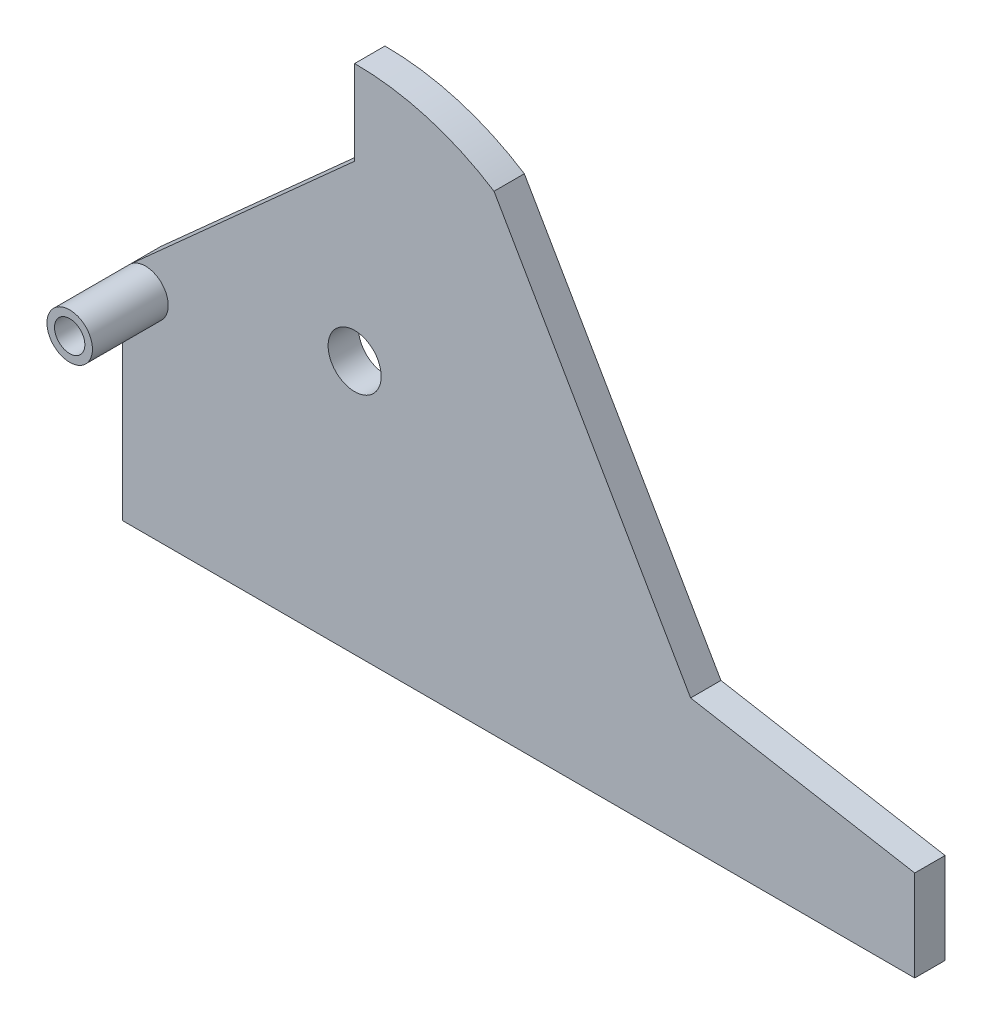
ISO-10303-21;
HEADER;
FILE_DESCRIPTION(('STEP AP214'),'2;1');
FILE_NAME('part.step','',(''),(''),'','','');
FILE_SCHEMA(('AUTOMOTIVE_DESIGN { 1 0 10303 214 1 1 1 1 }'));
ENDSEC;
DATA;
#1=APPLICATION_CONTEXT('core data for automotive mechanical design processes');
#2=APPLICATION_PROTOCOL_DEFINITION('international standard','automotive_design',2000,#1);
#3=PRODUCT_CONTEXT('',#1,'mechanical');
#4=PRODUCT('Part','Part','',(#3));
#5=PRODUCT_RELATED_PRODUCT_CATEGORY('part','',(#4));
#6=PRODUCT_DEFINITION_FORMATION('','',#4);
#7=PRODUCT_DEFINITION_CONTEXT('part definition',#1,'design');
#8=PRODUCT_DEFINITION('design','',#6,#7);
#9=PRODUCT_DEFINITION_SHAPE('','',#8);
#10=(LENGTH_UNIT() NAMED_UNIT(*) SI_UNIT(.MILLI.,.METRE.));
#11=(NAMED_UNIT(*) PLANE_ANGLE_UNIT() SI_UNIT($,.RADIAN.));
#12=(NAMED_UNIT(*) SI_UNIT($,.STERADIAN.) SOLID_ANGLE_UNIT());
#13=UNCERTAINTY_MEASURE_WITH_UNIT(LENGTH_MEASURE(1.E-05),#10,'distance_accuracy_value','');
#14=(GEOMETRIC_REPRESENTATION_CONTEXT(3) GLOBAL_UNCERTAINTY_ASSIGNED_CONTEXT((#13)) GLOBAL_UNIT_ASSIGNED_CONTEXT((#10,
#11,#12)) REPRESENTATION_CONTEXT('',''));
#15=CARTESIAN_POINT('',(0.,0.,0.));
#16=DIRECTION('',(0.,0.,1.));
#17=DIRECTION('',(1.,0.,0.));
#18=AXIS2_PLACEMENT_3D('',#15,#16,#17);
#19=CARTESIAN_POINT('',(153.,167.740187298071,20.));
#20=DIRECTION('',(0.,0.,-1.));
#21=DIRECTION('',(-1.,0.,0.));
#22=AXIS2_PLACEMENT_3D('',#19,#20,#21);
#23=CYLINDRICAL_SURFACE('',#22,170.);
#24=CARTESIAN_POINT('',(153.,167.740187298071,0.));
#25=DIRECTION('',(0.,0.,1.));
#26=DIRECTION('',(1.,0.,0.));
#27=AXIS2_PLACEMENT_3D('',#24,#25,#26);
#28=CIRCLE('',#27,170.);
#29=CARTESIAN_POINT('',(244.94,310.733321398979,0.));
#30=VERTEX_POINT('',#29);
#31=CARTESIAN_POINT('',(153.,337.740187298071,0.));
#32=VERTEX_POINT('',#31);
#33=EDGE_CURVE('E252',#30,#32,#28,.T.);
#34=ORIENTED_EDGE('',*,*,#33,.T.);
#35=DIRECTION('',(0.,0.,-1.));
#36=VECTOR('',#35,1.);
#37=CARTESIAN_POINT('',(153.,337.740187298071,20.));
#38=LINE('',#37,#36);
#39=CARTESIAN_POINT('',(153.,337.740187298071,20.));
#40=VERTEX_POINT('',#39);
#41=EDGE_CURVE('E216',#40,#32,#38,.T.);
#42=ORIENTED_EDGE('',*,*,#41,.F.);
#43=CARTESIAN_POINT('',(153.,167.740187298071,20.));
#44=DIRECTION('',(0.,0.,1.));
#45=DIRECTION('',(1.,0.,0.));
#46=AXIS2_PLACEMENT_3D('',#43,#44,#45);
#47=CIRCLE('',#46,170.);
#48=CARTESIAN_POINT('',(244.94,310.733321398979,20.));
#49=VERTEX_POINT('',#48);
#50=EDGE_CURVE('E238',#49,#40,#47,.T.);
#51=ORIENTED_EDGE('',*,*,#50,.F.);
#52=DIRECTION('',(0.,0.,-1.));
#53=VECTOR('',#52,1.);
#54=CARTESIAN_POINT('',(244.94,310.733321398979,20.));
#55=LINE('',#54,#53);
#56=EDGE_CURVE('E114',#49,#30,#55,.T.);
#57=ORIENTED_EDGE('',*,*,#56,.T.);
#58=EDGE_LOOP('',(#34,#42,#51,#57));
#59=FACE_BOUND('',#58,.T.);
#60=ADVANCED_FACE('F104',(#59),#23,.T.);
#61=CARTESIAN_POINT('',(153.,0.,20.));
#62=DIRECTION('',(-1.,0.,0.));
#63=DIRECTION('',(0.,0.,1.));
#64=AXIS2_PLACEMENT_3D('',#61,#62,#63);
#65=PLANE('',#64);
#66=DIRECTION('',(0.,1.,0.));
#67=VECTOR('',#66,1.);
#68=CARTESIAN_POINT('',(153.,0.,0.));
#69=LINE('',#68,#67);
#70=CARTESIAN_POINT('',(153.,281.918848090833,0.));
#71=VERTEX_POINT('',#70);
#72=EDGE_CURVE('E255',#71,#32,#69,.T.);
#73=ORIENTED_EDGE('',*,*,#72,.F.);
#74=DIRECTION('',(0.,0.,-1.));
#75=VECTOR('',#74,1.);
#76=CARTESIAN_POINT('',(153.,281.918848090833,20.));
#77=LINE('',#76,#75);
#78=CARTESIAN_POINT('',(153.,281.918848090833,20.));
#79=VERTEX_POINT('',#78);
#80=EDGE_CURVE('E214',#79,#71,#77,.T.);
#81=ORIENTED_EDGE('',*,*,#80,.F.);
#82=DIRECTION('',(0.,1.,0.));
#83=VECTOR('',#82,1.);
#84=CARTESIAN_POINT('',(153.,0.,20.));
#85=LINE('',#84,#83);
#86=EDGE_CURVE('E240',#79,#40,#85,.T.);
#87=ORIENTED_EDGE('',*,*,#86,.T.);
#88=ORIENTED_EDGE('',*,*,#41,.T.);
#89=EDGE_LOOP('',(#73,#81,#87,#88));
#90=FACE_BOUND('',#89,.T.);
#91=ADVANCED_FACE('F284',(#90),#65,.T.);
#92=CARTESIAN_POINT('',(-71.9216253841728,80.190761516644,20.));
#93=DIRECTION('',(-0.66768118292682,0.744447337268019,0.));
#94=DIRECTION('',(-0.744447337268019,-0.66768118292682,0.));
#95=AXIS2_PLACEMENT_3D('',#92,#93,#94);
#96=PLANE('',#95);
#97=DIRECTION('',(0.744447337268019,0.66768118292682,0.));
#98=VECTOR('',#97,1.);
#99=CARTESIAN_POINT('',(-71.9216253841728,80.190761516644,0.));
#100=LINE('',#99,#98);
#101=CARTESIAN_POINT('',(4.98478225609769,149.16671005902,0.));
#102=VERTEX_POINT('',#101);
#103=EDGE_CURVE('E258',#102,#71,#100,.T.);
#104=ORIENTED_EDGE('',*,*,#103,.F.);
#105=DIRECTION('',(0.,0.,-1.));
#106=VECTOR('',#105,1.);
#107=CARTESIAN_POINT('',(4.98478225609769,149.16671005902,20.));
#108=LINE('',#107,#106);
#109=CARTESIAN_POINT('',(4.9847822560977,149.16671005902,20.));
#110=VERTEX_POINT('',#109);
#111=EDGE_CURVE('E212',#110,#102,#108,.T.);
#112=ORIENTED_EDGE('',*,*,#111,.F.);
#113=DIRECTION('',(0.744447337268019,0.66768118292682,0.));
#114=VECTOR('',#113,1.);
#115=CARTESIAN_POINT('',(-71.9216253841728,80.190761516644,20.));
#116=LINE('',#115,#114);
#117=EDGE_CURVE('E243',#110,#79,#116,.T.);
#118=ORIENTED_EDGE('',*,*,#117,.T.);
#119=ORIENTED_EDGE('',*,*,#80,.T.);
#120=EDGE_LOOP('',(#104,#112,#118,#119));
#121=FACE_BOUND('',#120,.T.);
#122=ADVANCED_FACE('F289',(#121),#96,.T.);
#123=CARTESIAN_POINT('',(0.,0.,20.));
#124=DIRECTION('',(-1.,0.,0.));
#125=DIRECTION('',(0.,0.,1.));
#126=AXIS2_PLACEMENT_3D('',#123,#124,#125);
#127=PLANE('',#126);
#128=DIRECTION('',(0.,1.,0.));
#129=VECTOR('',#128,1.);
#130=CARTESIAN_POINT('',(0.,0.,0.));
#131=LINE('',#130,#129);
#132=CARTESIAN_POINT('',(0.,0.,0.));
#133=VERTEX_POINT('',#132);
#134=CARTESIAN_POINT('',(0.,138.,0.));
#135=VERTEX_POINT('',#134);
#136=EDGE_CURVE('E261',#133,#135,#131,.T.);
#137=ORIENTED_EDGE('',*,*,#136,.F.);
#138=DIRECTION('',(0.,0.,-1.));
#139=VECTOR('',#138,1.);
#140=CARTESIAN_POINT('',(0.,0.,20.));
#141=LINE('',#140,#139);
#142=CARTESIAN_POINT('',(0.,0.,20.));
#143=VERTEX_POINT('',#142);
#144=EDGE_CURVE('E204',#143,#133,#141,.T.);
#145=ORIENTED_EDGE('',*,*,#144,.F.);
#146=DIRECTION('',(0.,1.,0.));
#147=VECTOR('',#146,1.);
#148=CARTESIAN_POINT('',(0.,0.,20.));
#149=LINE('',#148,#147);
#150=CARTESIAN_POINT('',(0.,138.,20.));
#151=VERTEX_POINT('',#150);
#152=EDGE_CURVE('E198',#143,#151,#149,.T.);
#153=ORIENTED_EDGE('',*,*,#152,.T.);
#154=DIRECTION('',(0.,0.,-1.));
#155=VECTOR('',#154,1.);
#156=CARTESIAN_POINT('',(0.,138.,20.));
#157=LINE('',#156,#155);
#158=EDGE_CURVE('E206',#151,#135,#157,.T.);
#159=ORIENTED_EDGE('',*,*,#158,.T.);
#160=EDGE_LOOP('',(#137,#145,#153,#159));
#161=FACE_BOUND('',#160,.T.);
#162=ADVANCED_FACE('F295',(#161),#127,.T.);
#163=CARTESIAN_POINT('',(0.,0.,20.));
#164=DIRECTION('',(0.,1.,0.));
#165=DIRECTION('',(0.,0.,1.));
#166=AXIS2_PLACEMENT_3D('',#163,#164,#165);
#167=PLANE('',#166);
#168=DIRECTION('',(1.,0.,0.));
#169=VECTOR('',#168,1.);
#170=CARTESIAN_POINT('',(0.,0.,0.));
#171=LINE('',#170,#169);
#172=CARTESIAN_POINT('',(522.5,0.,0.));
#173=VERTEX_POINT('',#172);
#174=EDGE_CURVE('E203',#133,#173,#171,.T.);
#175=ORIENTED_EDGE('',*,*,#174,.T.);
#176=DIRECTION('',(0.,0.,-1.));
#177=VECTOR('',#176,1.);
#178=CARTESIAN_POINT('',(522.5,0.,20.));
#179=LINE('',#178,#177);
#180=CARTESIAN_POINT('',(522.5,0.,20.));
#181=VERTEX_POINT('',#180);
#182=EDGE_CURVE('E188',#181,#173,#179,.T.);
#183=ORIENTED_EDGE('',*,*,#182,.F.);
#184=DIRECTION('',(1.,0.,0.));
#185=VECTOR('',#184,1.);
#186=CARTESIAN_POINT('',(0.,0.,20.));
#187=LINE('',#186,#185);
#188=EDGE_CURVE('E191',#143,#181,#187,.T.);
#189=ORIENTED_EDGE('',*,*,#188,.F.);
#190=ORIENTED_EDGE('',*,*,#144,.T.);
#191=EDGE_LOOP('',(#175,#183,#189,#190));
#192=FACE_BOUND('',#191,.T.);
#193=ADVANCED_FACE('F201',(#192),#167,.F.);
#194=CARTESIAN_POINT('',(522.5,0.,20.));
#195=DIRECTION('',(-1.,0.,0.));
#196=DIRECTION('',(0.,0.,1.));
#197=AXIS2_PLACEMENT_3D('',#194,#195,#196);
#198=PLANE('',#197);
#199=DIRECTION('',(0.,1.,0.));
#200=VECTOR('',#199,1.);
#201=CARTESIAN_POINT('',(522.5,0.,0.));
#202=LINE('',#201,#200);
#203=CARTESIAN_POINT('',(522.5,60.,0.));
#204=VERTEX_POINT('',#203);
#205=EDGE_CURVE('E265',#173,#204,#202,.T.);
#206=ORIENTED_EDGE('',*,*,#205,.T.);
#207=DIRECTION('',(0.,0.,-1.));
#208=VECTOR('',#207,1.);
#209=CARTESIAN_POINT('',(522.5,60.,20.));
#210=LINE('',#209,#208);
#211=CARTESIAN_POINT('',(522.5,60.,20.));
#212=VERTEX_POINT('',#211);
#213=EDGE_CURVE('E190',#212,#204,#210,.T.);
#214=ORIENTED_EDGE('',*,*,#213,.F.);
#215=DIRECTION('',(0.,1.,0.));
#216=VECTOR('',#215,1.);
#217=CARTESIAN_POINT('',(522.5,0.,20.));
#218=LINE('',#217,#216);
#219=EDGE_CURVE('E183',#181,#212,#218,.T.);
#220=ORIENTED_EDGE('',*,*,#219,.F.);
#221=ORIENTED_EDGE('',*,*,#182,.T.);
#222=EDGE_LOOP('',(#206,#214,#220,#221));
#223=FACE_BOUND('',#222,.T.);
#224=ADVANCED_FACE('F186',(#223),#198,.F.);
#225=CARTESIAN_POINT('',(26.0159071194517,147.543541067409,20.));
#226=DIRECTION('',(-0.173648177666931,-0.984807753012208,0.));
#227=DIRECTION('',(0.984807753012208,-0.173648177666931,0.));
#228=AXIS2_PLACEMENT_3D('',#225,#226,#227);
#229=PLANE('',#228);
#230=DIRECTION('',(-0.984807753012208,0.173648177666931,0.));
#231=VECTOR('',#230,1.);
#232=CARTESIAN_POINT('',(26.0159071194517,147.543541067409,0.));
#233=LINE('',#232,#231);
#234=CARTESIAN_POINT('',(374.649400312245,86.0700498388778,0.));
#235=VERTEX_POINT('',#234);
#236=EDGE_CURVE('E155',#204,#235,#233,.T.);
#237=ORIENTED_EDGE('',*,*,#236,.T.);
#238=DIRECTION('',(0.,0.,-1.));
#239=VECTOR('',#238,1.);
#240=CARTESIAN_POINT('',(374.649400312245,86.0700498388778,20.));
#241=LINE('',#240,#239);
#242=CARTESIAN_POINT('',(374.649400312245,86.0700498388778,20.));
#243=VERTEX_POINT('',#242);
#244=EDGE_CURVE('E162',#243,#235,#241,.T.);
#245=ORIENTED_EDGE('',*,*,#244,.F.);
#246=DIRECTION('',(-0.984807753012208,0.173648177666931,0.));
#247=VECTOR('',#246,1.);
#248=CARTESIAN_POINT('',(26.0159071194517,147.543541067409,20.));
#249=LINE('',#248,#247);
#250=EDGE_CURVE('E123',#212,#243,#249,.T.);
#251=ORIENTED_EDGE('',*,*,#250,.F.);
#252=ORIENTED_EDGE('',*,*,#213,.T.);
#253=EDGE_LOOP('',(#237,#245,#251,#252));
#254=FACE_BOUND('',#253,.T.);
#255=ADVANCED_FACE('F268',(#254),#229,.F.);
#256=CARTESIAN_POINT('',(318.256475066915,183.745461551224,20.));
#257=DIRECTION('',(0.86602540378444,0.499999999999998,0.));
#258=DIRECTION('',(-0.499999999999998,0.86602540378444,0.));
#259=AXIS2_PLACEMENT_3D('',#256,#257,#258);
#260=PLANE('',#259);
#261=DIRECTION('',(0.499999999999998,-0.86602540378444,0.));
#262=VECTOR('',#261,1.);
#263=CARTESIAN_POINT('',(318.256475066915,183.745461551224,0.));
#264=LINE('',#263,#262);
#265=EDGE_CURVE('E250',#30,#235,#264,.T.);
#266=ORIENTED_EDGE('',*,*,#265,.F.);
#267=ORIENTED_EDGE('',*,*,#56,.F.);
#268=DIRECTION('',(0.499999999999998,-0.86602540378444,0.));
#269=VECTOR('',#268,1.);
#270=CARTESIAN_POINT('',(318.256475066915,183.745461551224,20.));
#271=LINE('',#270,#269);
#272=EDGE_CURVE('E236',#49,#243,#271,.T.);
#273=ORIENTED_EDGE('',*,*,#272,.T.);
#274=ORIENTED_EDGE('',*,*,#244,.T.);
#275=EDGE_LOOP('',(#266,#267,#273,#274));
#276=FACE_BOUND('',#275,.T.);
#277=ADVANCED_FACE('F271',(#276),#260,.T.);
#278=CARTESIAN_POINT('',(153.,167.740187298071,20.));
#279=DIRECTION('',(0.,0.,-1.));
#280=DIRECTION('',(-1.,0.,0.));
#281=AXIS2_PLACEMENT_3D('',#278,#279,#280);
#282=CYLINDRICAL_SURFACE('',#281,17.5);
#283=CARTESIAN_POINT('',(153.,167.740187298071,20.));
#284=DIRECTION('',(0.,0.,1.));
#285=DIRECTION('',(1.,0.,0.));
#286=AXIS2_PLACEMENT_3D('',#283,#284,#285);
#287=CIRCLE('',#286,17.5);
#288=CARTESIAN_POINT('',(170.5,167.740187298071,20.));
#289=VERTEX_POINT('',#288);
#290=EDGE_CURVE('E233',#289,#289,#287,.T.);
#291=ORIENTED_EDGE('',*,*,#290,.T.);
#292=EDGE_LOOP('',(#291));
#293=FACE_BOUND('',#292,.T.);
#294=CARTESIAN_POINT('',(153.,167.740187298071,0.));
#295=DIRECTION('',(0.,0.,1.));
#296=DIRECTION('',(1.,0.,0.));
#297=AXIS2_PLACEMENT_3D('',#294,#295,#296);
#298=CIRCLE('',#297,17.5);
#299=CARTESIAN_POINT('',(170.5,167.740187298071,0.));
#300=VERTEX_POINT('',#299);
#301=EDGE_CURVE('E224',#300,#300,#298,.T.);
#302=ORIENTED_EDGE('',*,*,#301,.F.);
#303=EDGE_LOOP('',(#302));
#304=FACE_BOUND('',#303,.T.);
#305=ADVANCED_FACE('F273',(#293,#304),#282,.F.);
#306=CARTESIAN_POINT('',(0.,0.,0.));
#307=DIRECTION('',(0.,0.,1.));
#308=DIRECTION('',(1.,0.,0.));
#309=AXIS2_PLACEMENT_3D('',#306,#307,#308);
#310=PLANE('',#309);
#311=ORIENTED_EDGE('',*,*,#301,.T.);
#312=EDGE_LOOP('',(#311));
#313=FACE_BOUND('',#312,.T.);
#314=ORIENTED_EDGE('',*,*,#265,.T.);
#315=ORIENTED_EDGE('',*,*,#236,.F.);
#316=ORIENTED_EDGE('',*,*,#205,.F.);
#317=ORIENTED_EDGE('',*,*,#174,.F.);
#318=ORIENTED_EDGE('',*,*,#136,.T.);
#319=CARTESIAN_POINT('',(15.,138.,0.));
#320=DIRECTION('',(0.,0.,1.));
#321=DIRECTION('',(1.,0.,0.));
#322=AXIS2_PLACEMENT_3D('',#319,#320,#321);
#323=CIRCLE('',#322,15.);
#324=EDGE_CURVE('E108',#102,#135,#323,.T.);
#325=ORIENTED_EDGE('',*,*,#324,.F.);
#326=ORIENTED_EDGE('',*,*,#103,.T.);
#327=ORIENTED_EDGE('',*,*,#72,.T.);
#328=ORIENTED_EDGE('',*,*,#33,.F.);
#329=EDGE_LOOP('',(#314,#315,#316,#317,#318,#325,#326,#327,#328));
#330=FACE_BOUND('',#329,.T.);
#331=CARTESIAN_POINT('',(15.,138.,0.));
#332=DIRECTION('',(0.,0.,1.));
#333=DIRECTION('',(1.,0.,0.));
#334=AXIS2_PLACEMENT_3D('',#331,#332,#333);
#335=CIRCLE('',#334,10.);
#336=CARTESIAN_POINT('',(25.,138.,0.));
#337=VERTEX_POINT('',#336);
#338=EDGE_CURVE('E218',#337,#337,#335,.T.);
#339=ORIENTED_EDGE('',*,*,#338,.T.);
#340=EDGE_LOOP('',(#339));
#341=FACE_BOUND('',#340,.T.);
#342=ADVANCED_FACE('F270',(#313,#330,#341),#310,.F.);
#343=CARTESIAN_POINT('',(0.,0.,20.));
#344=DIRECTION('',(0.,0.,1.));
#345=DIRECTION('',(1.,0.,0.));
#346=AXIS2_PLACEMENT_3D('',#343,#344,#345);
#347=PLANE('',#346);
#348=CARTESIAN_POINT('',(15.,138.,20.));
#349=DIRECTION('',(0.,0.,1.));
#350=DIRECTION('',(1.,0.,0.));
#351=AXIS2_PLACEMENT_3D('',#348,#349,#350);
#352=CIRCLE('',#351,15.);
#353=EDGE_CURVE('E12',#151,#110,#352,.T.);
#354=ORIENTED_EDGE('',*,*,#353,.F.);
#355=ORIENTED_EDGE('',*,*,#152,.F.);
#356=ORIENTED_EDGE('',*,*,#188,.T.);
#357=ORIENTED_EDGE('',*,*,#219,.T.);
#358=ORIENTED_EDGE('',*,*,#250,.T.);
#359=ORIENTED_EDGE('',*,*,#272,.F.);
#360=ORIENTED_EDGE('',*,*,#50,.T.);
#361=ORIENTED_EDGE('',*,*,#86,.F.);
#362=ORIENTED_EDGE('',*,*,#117,.F.);
#363=EDGE_LOOP('',(#354,#355,#356,#357,#358,#359,#360,#361,#362));
#364=FACE_BOUND('',#363,.T.);
#365=ORIENTED_EDGE('',*,*,#290,.F.);
#366=EDGE_LOOP('',(#365));
#367=FACE_BOUND('',#366,.T.);
#368=ADVANCED_FACE('F195',(#364,#367),#347,.T.);
#369=CARTESIAN_POINT('',(15.,138.,20.));
#370=DIRECTION('',(0.,0.,-1.));
#371=DIRECTION('',(-1.,0.,0.));
#372=AXIS2_PLACEMENT_3D('',#369,#370,#371);
#373=CYLINDRICAL_SURFACE('',#372,10.);
#374=ORIENTED_EDGE('',*,*,#338,.F.);
#375=EDGE_LOOP('',(#374));
#376=FACE_BOUND('',#375,.T.);
#377=CARTESIAN_POINT('',(15.,138.,70.));
#378=DIRECTION('',(0.,0.,1.));
#379=DIRECTION('',(1.,0.,0.));
#380=AXIS2_PLACEMENT_3D('',#377,#378,#379);
#381=CIRCLE('',#380,10.);
#382=CARTESIAN_POINT('',(25.,138.,70.));
#383=VERTEX_POINT('',#382);
#384=EDGE_CURVE('E226',#383,#383,#381,.T.);
#385=ORIENTED_EDGE('',*,*,#384,.T.);
#386=EDGE_LOOP('',(#385));
#387=FACE_BOUND('',#386,.T.);
#388=ADVANCED_FACE('F309',(#376,#387),#373,.F.);
#389=CARTESIAN_POINT('',(15.,138.,20.));
#390=DIRECTION('',(0.,0.,-1.));
#391=DIRECTION('',(-1.,0.,0.));
#392=AXIS2_PLACEMENT_3D('',#389,#390,#391);
#393=CYLINDRICAL_SURFACE('',#392,15.);
#394=ORIENTED_EDGE('',*,*,#111,.T.);
#395=ORIENTED_EDGE('',*,*,#324,.T.);
#396=ORIENTED_EDGE('',*,*,#158,.F.);
#397=ORIENTED_EDGE('',*,*,#353,.T.);
#398=EDGE_LOOP('',(#394,#395,#396,#397));
#399=FACE_BOUND('',#398,.T.);
#400=CARTESIAN_POINT('',(15.,138.,70.));
#401=DIRECTION('',(0.,0.,1.));
#402=DIRECTION('',(1.,0.,0.));
#403=AXIS2_PLACEMENT_3D('',#400,#401,#402);
#404=CIRCLE('',#403,15.);
#405=CARTESIAN_POINT('',(30.,138.,70.));
#406=VERTEX_POINT('',#405);
#407=EDGE_CURVE('E220',#406,#406,#404,.T.);
#408=ORIENTED_EDGE('',*,*,#407,.F.);
#409=EDGE_LOOP('',(#408));
#410=FACE_BOUND('',#409,.T.);
#411=ADVANCED_FACE('F106',(#399,#410),#393,.T.);
#412=CARTESIAN_POINT('',(15.,138.,70.));
#413=DIRECTION('',(0.,0.,1.));
#414=DIRECTION('',(1.,0.,0.));
#415=AXIS2_PLACEMENT_3D('',#412,#413,#414);
#416=PLANE('',#415);
#417=ORIENTED_EDGE('',*,*,#407,.T.);
#418=EDGE_LOOP('',(#417));
#419=FACE_BOUND('',#418,.T.);
#420=ORIENTED_EDGE('',*,*,#384,.F.);
#421=EDGE_LOOP('',(#420));
#422=FACE_BOUND('',#421,.T.);
#423=ADVANCED_FACE('F310',(#419,#422),#416,.T.);
#424=CLOSED_SHELL('',(#60,#91,#122,#162,#193,#224,#255,#277,#305,#342,#368,#388,#411,#423));
#425=MANIFOLD_SOLID_BREP('B2',#424);
#426=ADVANCED_BREP_SHAPE_REPRESENTATION('',(#18,#425),#14);
#427=SHAPE_DEFINITION_REPRESENTATION(#9,#426);
ENDSEC;
END-ISO-10303-21;
